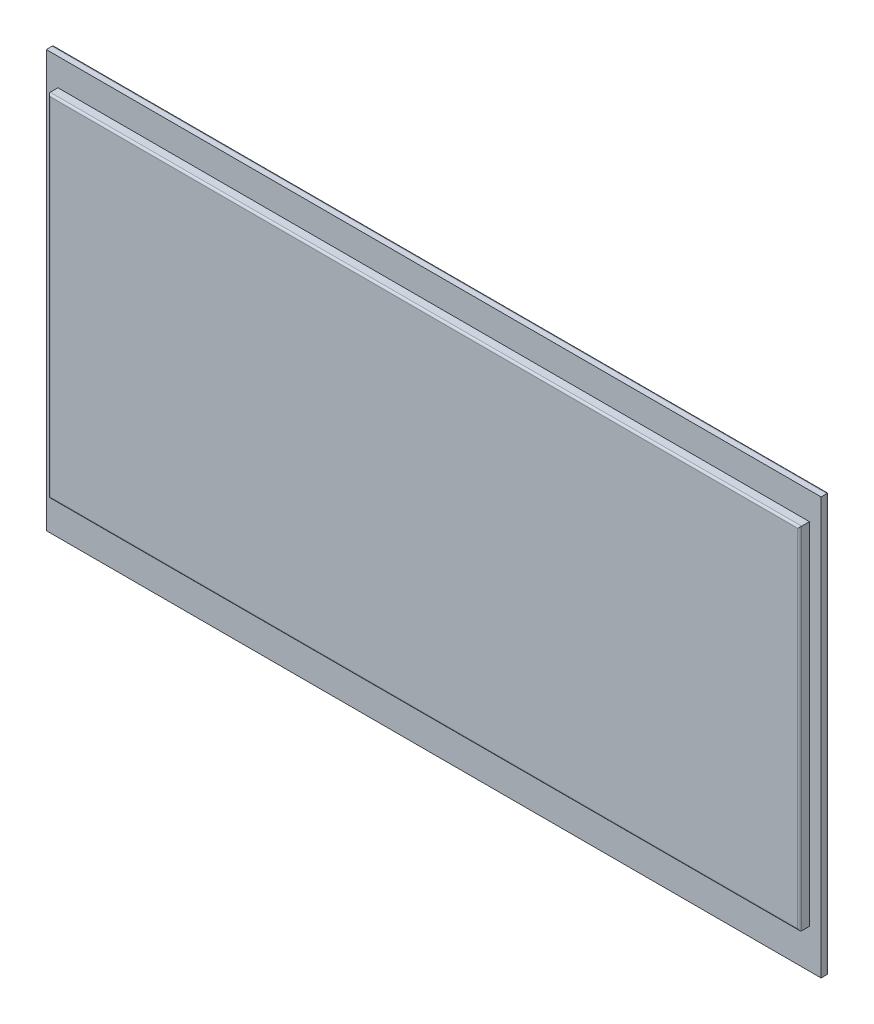
ISO-10303-21;
HEADER;
FILE_DESCRIPTION(('STEP AP214'),'2;1');
FILE_NAME('part.step','',(''),(''),'','','');
FILE_SCHEMA(('AUTOMOTIVE_DESIGN { 1 0 10303 214 1 1 1 1 }'));
ENDSEC;
DATA;
#1=APPLICATION_CONTEXT('core data for automotive mechanical design processes');
#2=APPLICATION_PROTOCOL_DEFINITION('international standard','automotive_design',2000,#1);
#3=PRODUCT_CONTEXT('',#1,'mechanical');
#4=PRODUCT('Part','Part','',(#3));
#5=PRODUCT_RELATED_PRODUCT_CATEGORY('part','',(#4));
#6=PRODUCT_DEFINITION_FORMATION('','',#4);
#7=PRODUCT_DEFINITION_CONTEXT('part definition',#1,'design');
#8=PRODUCT_DEFINITION('design','',#6,#7);
#9=PRODUCT_DEFINITION_SHAPE('','',#8);
#10=(LENGTH_UNIT() NAMED_UNIT(*) SI_UNIT(.MILLI.,.METRE.));
#11=(NAMED_UNIT(*) PLANE_ANGLE_UNIT() SI_UNIT($,.RADIAN.));
#12=(NAMED_UNIT(*) SI_UNIT($,.STERADIAN.) SOLID_ANGLE_UNIT());
#13=UNCERTAINTY_MEASURE_WITH_UNIT(LENGTH_MEASURE(1.E-05),#10,'distance_accuracy_value','');
#14=(GEOMETRIC_REPRESENTATION_CONTEXT(3) GLOBAL_UNCERTAINTY_ASSIGNED_CONTEXT((#13)) GLOBAL_UNIT_ASSIGNED_CONTEXT((#10,
#11,#12)) REPRESENTATION_CONTEXT('',''));
#15=CARTESIAN_POINT('',(0.,0.,0.));
#16=DIRECTION('',(0.,0.,1.));
#17=DIRECTION('',(1.,0.,0.));
#18=AXIS2_PLACEMENT_3D('',#15,#16,#17);
#19=CARTESIAN_POINT('',(0.,0.,2.));
#20=DIRECTION('',(0.,0.,-1.));
#21=DIRECTION('',(-1.,0.,0.));
#22=AXIS2_PLACEMENT_3D('',#19,#20,#21);
#23=PLANE('',#22);
#24=DIRECTION('',(0.,1.,0.));
#25=VECTOR('',#24,1.);
#26=CARTESIAN_POINT('',(99.5,-53.5,2.));
#27=LINE('',#26,#25);
#28=CARTESIAN_POINT('',(99.5,-53.5,2.));
#29=VERTEX_POINT('',#28);
#30=CARTESIAN_POINT('',(99.5,53.5,2.));
#31=VERTEX_POINT('',#30);
#32=EDGE_CURVE('E180',#29,#31,#27,.T.);
#33=ORIENTED_EDGE('',*,*,#32,.T.);
#34=DIRECTION('',(-1.,0.,0.));
#35=VECTOR('',#34,1.);
#36=CARTESIAN_POINT('',(-99.5,53.5,2.));
#37=LINE('',#36,#35);
#38=CARTESIAN_POINT('',(-99.5,53.5,2.));
#39=VERTEX_POINT('',#38);
#40=EDGE_CURVE('E184',#31,#39,#37,.T.);
#41=ORIENTED_EDGE('',*,*,#40,.T.);
#42=DIRECTION('',(0.,-1.,0.));
#43=VECTOR('',#42,1.);
#44=CARTESIAN_POINT('',(-99.5,-53.5,2.));
#45=LINE('',#44,#43);
#46=CARTESIAN_POINT('',(-99.5,-53.5,2.));
#47=VERTEX_POINT('',#46);
#48=EDGE_CURVE('E187',#39,#47,#45,.T.);
#49=ORIENTED_EDGE('',*,*,#48,.T.);
#50=DIRECTION('',(1.,0.,0.));
#51=VECTOR('',#50,1.);
#52=CARTESIAN_POINT('',(-99.5,-53.5,2.));
#53=LINE('',#52,#51);
#54=EDGE_CURVE('E190',#47,#29,#53,.T.);
#55=ORIENTED_EDGE('',*,*,#54,.T.);
#56=EDGE_LOOP('',(#33,#41,#49,#55));
#57=FACE_BOUND('',#56,.T.);
#58=DIRECTION('',(0.,-1.,0.));
#59=VECTOR('',#58,1.);
#60=CARTESIAN_POINT('',(-96.5,46.5,2.));
#61=LINE('',#60,#59);
#62=CARTESIAN_POINT('',(-96.5,46.5,2.));
#63=VERTEX_POINT('',#62);
#64=CARTESIAN_POINT('',(-96.5,-43.5,2.));
#65=VERTEX_POINT('',#64);
#66=EDGE_CURVE('E165',#63,#65,#61,.T.);
#67=ORIENTED_EDGE('',*,*,#66,.F.);
#68=DIRECTION('',(-1.,0.,0.));
#69=VECTOR('',#68,1.);
#70=CARTESIAN_POINT('',(-96.5,46.5,2.));
#71=LINE('',#70,#69);
#72=CARTESIAN_POINT('',(96.5,46.5,2.));
#73=VERTEX_POINT('',#72);
#74=EDGE_CURVE('E159',#73,#63,#71,.T.);
#75=ORIENTED_EDGE('',*,*,#74,.F.);
#76=DIRECTION('',(0.,1.,0.));
#77=VECTOR('',#76,1.);
#78=CARTESIAN_POINT('',(96.5,46.5,2.));
#79=LINE('',#78,#77);
#80=CARTESIAN_POINT('',(96.5,-43.5,2.));
#81=VERTEX_POINT('',#80);
#82=EDGE_CURVE('E142',#81,#73,#79,.T.);
#83=ORIENTED_EDGE('',*,*,#82,.F.);
#84=DIRECTION('',(1.,0.,0.));
#85=VECTOR('',#84,1.);
#86=CARTESIAN_POINT('',(-96.5,-43.5,2.));
#87=LINE('',#86,#85);
#88=EDGE_CURVE('E156',#65,#81,#87,.T.);
#89=ORIENTED_EDGE('',*,*,#88,.F.);
#90=EDGE_LOOP('',(#67,#75,#83,#89));
#91=FACE_BOUND('',#90,.T.);
#92=ADVANCED_FACE('F45',(#57,#91),#23,.F.);
#93=CARTESIAN_POINT('',(99.5,-53.5,2.));
#94=DIRECTION('',(-1.,0.,0.));
#95=DIRECTION('',(0.,0.,1.));
#96=AXIS2_PLACEMENT_3D('',#93,#94,#95);
#97=PLANE('',#96);
#98=DIRECTION('',(0.,0.,-1.));
#99=VECTOR('',#98,1.);
#100=CARTESIAN_POINT('',(99.5,-53.5,2.));
#101=LINE('',#100,#99);
#102=CARTESIAN_POINT('',(99.5,-53.5,0.5));
#103=VERTEX_POINT('',#102);
#104=EDGE_CURVE('E193',#29,#103,#101,.T.);
#105=ORIENTED_EDGE('',*,*,#104,.T.);
#106=DIRECTION('',(0.,1.,0.));
#107=VECTOR('',#106,1.);
#108=CARTESIAN_POINT('',(99.5,53.5,0.5));
#109=LINE('',#108,#107);
#110=CARTESIAN_POINT('',(99.5,53.5,0.5));
#111=VERTEX_POINT('',#110);
#112=EDGE_CURVE('E11',#103,#111,#109,.T.);
#113=ORIENTED_EDGE('',*,*,#112,.T.);
#114=DIRECTION('',(0.,0.,-1.));
#115=VECTOR('',#114,1.);
#116=CARTESIAN_POINT('',(99.5,53.5,2.));
#117=LINE('',#116,#115);
#118=EDGE_CURVE('E202',#31,#111,#117,.T.);
#119=ORIENTED_EDGE('',*,*,#118,.F.);
#120=ORIENTED_EDGE('',*,*,#32,.F.);
#121=EDGE_LOOP('',(#105,#113,#119,#120));
#122=FACE_BOUND('',#121,.T.);
#123=ADVANCED_FACE('F304',(#122),#97,.F.);
#124=CARTESIAN_POINT('',(-99.5,53.5,2.));
#125=DIRECTION('',(0.,-1.,0.));
#126=DIRECTION('',(0.,0.,-1.));
#127=AXIS2_PLACEMENT_3D('',#124,#125,#126);
#128=PLANE('',#127);
#129=ORIENTED_EDGE('',*,*,#118,.T.);
#130=DIRECTION('',(-1.,0.,0.));
#131=VECTOR('',#130,1.);
#132=CARTESIAN_POINT('',(-99.5,53.5,0.5));
#133=LINE('',#132,#131);
#134=CARTESIAN_POINT('',(-99.5,53.5,0.5));
#135=VERTEX_POINT('',#134);
#136=EDGE_CURVE('E231',#111,#135,#133,.T.);
#137=ORIENTED_EDGE('',*,*,#136,.T.);
#138=DIRECTION('',(0.,0.,-1.));
#139=VECTOR('',#138,1.);
#140=CARTESIAN_POINT('',(-99.5,53.5,2.));
#141=LINE('',#140,#139);
#142=EDGE_CURVE('E199',#39,#135,#141,.T.);
#143=ORIENTED_EDGE('',*,*,#142,.F.);
#144=ORIENTED_EDGE('',*,*,#40,.F.);
#145=EDGE_LOOP('',(#129,#137,#143,#144));
#146=FACE_BOUND('',#145,.T.);
#147=ADVANCED_FACE('F296',(#146),#128,.F.);
#148=CARTESIAN_POINT('',(-99.5,-53.5,2.));
#149=DIRECTION('',(1.,0.,0.));
#150=DIRECTION('',(0.,0.,-1.));
#151=AXIS2_PLACEMENT_3D('',#148,#149,#150);
#152=PLANE('',#151);
#153=ORIENTED_EDGE('',*,*,#142,.T.);
#154=DIRECTION('',(0.,-1.,0.));
#155=VECTOR('',#154,1.);
#156=CARTESIAN_POINT('',(-99.5,-53.5,0.5));
#157=LINE('',#156,#155);
#158=CARTESIAN_POINT('',(-99.5,-53.5,0.5));
#159=VERTEX_POINT('',#158);
#160=EDGE_CURVE('E70',#135,#159,#157,.T.);
#161=ORIENTED_EDGE('',*,*,#160,.T.);
#162=DIRECTION('',(0.,0.,-1.));
#163=VECTOR('',#162,1.);
#164=CARTESIAN_POINT('',(-99.5,-53.5,2.));
#165=LINE('',#164,#163);
#166=EDGE_CURVE('E196',#47,#159,#165,.T.);
#167=ORIENTED_EDGE('',*,*,#166,.F.);
#168=ORIENTED_EDGE('',*,*,#48,.F.);
#169=EDGE_LOOP('',(#153,#161,#167,#168));
#170=FACE_BOUND('',#169,.T.);
#171=ADVANCED_FACE('F299',(#170),#152,.F.);
#172=CARTESIAN_POINT('',(-99.5,-53.5,2.));
#173=DIRECTION('',(0.,1.,0.));
#174=DIRECTION('',(0.,0.,1.));
#175=AXIS2_PLACEMENT_3D('',#172,#173,#174);
#176=PLANE('',#175);
#177=ORIENTED_EDGE('',*,*,#166,.T.);
#178=DIRECTION('',(1.,0.,0.));
#179=VECTOR('',#178,1.);
#180=CARTESIAN_POINT('',(99.5,-53.5,0.5));
#181=LINE('',#180,#179);
#182=EDGE_CURVE('E55',#159,#103,#181,.T.);
#183=ORIENTED_EDGE('',*,*,#182,.T.);
#184=ORIENTED_EDGE('',*,*,#104,.F.);
#185=ORIENTED_EDGE('',*,*,#54,.F.);
#186=EDGE_LOOP('',(#177,#183,#184,#185));
#187=FACE_BOUND('',#186,.T.);
#188=ADVANCED_FACE('F305',(#187),#176,.F.);
#189=CARTESIAN_POINT('',(0.,0.,0.));
#190=DIRECTION('',(0.,0.,-1.));
#191=DIRECTION('',(-1.,0.,0.));
#192=AXIS2_PLACEMENT_3D('',#189,#190,#191);
#193=PLANE('',#192);
#194=DIRECTION('',(0.,-1.,0.));
#195=VECTOR('',#194,1.);
#196=CARTESIAN_POINT('',(-99.,53.5,0.));
#197=LINE('',#196,#195);
#198=CARTESIAN_POINT('',(-99.,-53.,0.));
#199=VERTEX_POINT('',#198);
#200=CARTESIAN_POINT('',(-99.,53.,0.));
#201=VERTEX_POINT('',#200);
#202=EDGE_CURVE('E254',#199,#201,#197,.F.);
#203=ORIENTED_EDGE('',*,*,#202,.T.);
#204=DIRECTION('',(-1.,0.,0.));
#205=VECTOR('',#204,1.);
#206=CARTESIAN_POINT('',(99.5,53.,0.));
#207=LINE('',#206,#205);
#208=CARTESIAN_POINT('',(99.,53.,0.));
#209=VERTEX_POINT('',#208);
#210=EDGE_CURVE('E257',#201,#209,#207,.F.);
#211=ORIENTED_EDGE('',*,*,#210,.T.);
#212=DIRECTION('',(0.,1.,0.));
#213=VECTOR('',#212,1.);
#214=CARTESIAN_POINT('',(99.,-53.5,0.));
#215=LINE('',#214,#213);
#216=CARTESIAN_POINT('',(99.,-53.,0.));
#217=VERTEX_POINT('',#216);
#218=EDGE_CURVE('E248',#209,#217,#215,.F.);
#219=ORIENTED_EDGE('',*,*,#218,.T.);
#220=DIRECTION('',(1.,0.,0.));
#221=VECTOR('',#220,1.);
#222=CARTESIAN_POINT('',(-99.5,-53.,0.));
#223=LINE('',#222,#221);
#224=EDGE_CURVE('E251',#217,#199,#223,.F.);
#225=ORIENTED_EDGE('',*,*,#224,.T.);
#226=EDGE_LOOP('',(#203,#211,#219,#225));
#227=FACE_BOUND('',#226,.T.);
#228=ADVANCED_FACE('F287',(#227),#193,.T.);
#229=CARTESIAN_POINT('',(-96.5,46.5,4.5));
#230=DIRECTION('',(1.,0.,0.));
#231=DIRECTION('',(0.,1.,0.));
#232=AXIS2_PLACEMENT_3D('',#229,#230,#231);
#233=PLANE('',#232);
#234=DIRECTION('',(0.,0.,-1.));
#235=VECTOR('',#234,1.);
#236=CARTESIAN_POINT('',(-96.5,-43.5,4.5));
#237=LINE('',#236,#235);
#238=CARTESIAN_POINT('',(-96.5,-43.5,4.));
#239=VERTEX_POINT('',#238);
#240=EDGE_CURVE('E149',#239,#65,#237,.T.);
#241=ORIENTED_EDGE('',*,*,#240,.F.);
#242=DIRECTION('',(0.,-1.,0.));
#243=VECTOR('',#242,1.);
#244=CARTESIAN_POINT('',(-96.5,46.5,4.));
#245=LINE('',#244,#243);
#246=CARTESIAN_POINT('',(-96.5,46.5,4.));
#247=VERTEX_POINT('',#246);
#248=EDGE_CURVE('E228',#239,#247,#245,.F.);
#249=ORIENTED_EDGE('',*,*,#248,.T.);
#250=DIRECTION('',(0.,0.,-1.));
#251=VECTOR('',#250,1.);
#252=CARTESIAN_POINT('',(-96.5,46.5,4.5));
#253=LINE('',#252,#251);
#254=EDGE_CURVE('E173',#247,#63,#253,.T.);
#255=ORIENTED_EDGE('',*,*,#254,.T.);
#256=ORIENTED_EDGE('',*,*,#66,.T.);
#257=EDGE_LOOP('',(#241,#249,#255,#256));
#258=FACE_BOUND('',#257,.T.);
#259=ADVANCED_FACE('F312',(#258),#233,.F.);
#260=CARTESIAN_POINT('',(-96.5,-43.5,4.5));
#261=DIRECTION('',(0.,1.,0.));
#262=DIRECTION('',(0.,0.,1.));
#263=AXIS2_PLACEMENT_3D('',#260,#261,#262);
#264=PLANE('',#263);
#265=DIRECTION('',(0.,0.,-1.));
#266=VECTOR('',#265,1.);
#267=CARTESIAN_POINT('',(96.5,-43.5,4.5));
#268=LINE('',#267,#266);
#269=CARTESIAN_POINT('',(96.5,-43.5,4.));
#270=VERTEX_POINT('',#269);
#271=EDGE_CURVE('E138',#270,#81,#268,.T.);
#272=ORIENTED_EDGE('',*,*,#271,.F.);
#273=DIRECTION('',(1.,0.,0.));
#274=VECTOR('',#273,1.);
#275=CARTESIAN_POINT('',(-96.5,-43.5,4.));
#276=LINE('',#275,#274);
#277=EDGE_CURVE('E225',#270,#239,#276,.F.);
#278=ORIENTED_EDGE('',*,*,#277,.T.);
#279=ORIENTED_EDGE('',*,*,#240,.T.);
#280=ORIENTED_EDGE('',*,*,#88,.T.);
#281=EDGE_LOOP('',(#272,#278,#279,#280));
#282=FACE_BOUND('',#281,.T.);
#283=ADVANCED_FACE('F162',(#282),#264,.F.);
#284=CARTESIAN_POINT('',(96.5,46.5,4.5));
#285=DIRECTION('',(-1.,0.,0.));
#286=DIRECTION('',(0.,-1.,0.));
#287=AXIS2_PLACEMENT_3D('',#284,#285,#286);
#288=PLANE('',#287);
#289=DIRECTION('',(0.,0.,-1.));
#290=VECTOR('',#289,1.);
#291=CARTESIAN_POINT('',(96.5,46.5,4.5));
#292=LINE('',#291,#290);
#293=CARTESIAN_POINT('',(96.5,46.5,4.));
#294=VERTEX_POINT('',#293);
#295=EDGE_CURVE('E150',#294,#73,#292,.T.);
#296=ORIENTED_EDGE('',*,*,#295,.F.);
#297=DIRECTION('',(0.,1.,0.));
#298=VECTOR('',#297,1.);
#299=CARTESIAN_POINT('',(96.5,-43.5,4.));
#300=LINE('',#299,#298);
#301=EDGE_CURVE('E144',#294,#270,#300,.F.);
#302=ORIENTED_EDGE('',*,*,#301,.T.);
#303=ORIENTED_EDGE('',*,*,#271,.T.);
#304=ORIENTED_EDGE('',*,*,#82,.T.);
#305=EDGE_LOOP('',(#296,#302,#303,#304));
#306=FACE_BOUND('',#305,.T.);
#307=ADVANCED_FACE('F141',(#306),#288,.F.);
#308=CARTESIAN_POINT('',(-96.5,46.5,4.5));
#309=DIRECTION('',(0.,-1.,0.));
#310=DIRECTION('',(0.,0.,-1.));
#311=AXIS2_PLACEMENT_3D('',#308,#309,#310);
#312=PLANE('',#311);
#313=ORIENTED_EDGE('',*,*,#254,.F.);
#314=DIRECTION('',(-1.,0.,0.));
#315=VECTOR('',#314,1.);
#316=CARTESIAN_POINT('',(96.5,46.5,4.));
#317=LINE('',#316,#315);
#318=EDGE_CURVE('E219',#247,#294,#317,.F.);
#319=ORIENTED_EDGE('',*,*,#318,.T.);
#320=ORIENTED_EDGE('',*,*,#295,.T.);
#321=ORIENTED_EDGE('',*,*,#74,.T.);
#322=EDGE_LOOP('',(#313,#319,#320,#321));
#323=FACE_BOUND('',#322,.T.);
#324=ADVANCED_FACE('F330',(#323),#312,.F.);
#325=CARTESIAN_POINT('',(0.,0.,4.5));
#326=DIRECTION('',(0.,0.,1.));
#327=DIRECTION('',(1.,0.,0.));
#328=AXIS2_PLACEMENT_3D('',#325,#326,#327);
#329=PLANE('',#328);
#330=DIRECTION('',(0.,1.,0.));
#331=VECTOR('',#330,1.);
#332=CARTESIAN_POINT('',(96.,46.5,4.5));
#333=LINE('',#332,#331);
#334=CARTESIAN_POINT('',(96.,-43.,4.5));
#335=VERTEX_POINT('',#334);
#336=CARTESIAN_POINT('',(96.,46.,4.5));
#337=VERTEX_POINT('',#336);
#338=EDGE_CURVE('E212',#335,#337,#333,.T.);
#339=ORIENTED_EDGE('',*,*,#338,.T.);
#340=DIRECTION('',(-1.,0.,0.));
#341=VECTOR('',#340,1.);
#342=CARTESIAN_POINT('',(-96.5,46.,4.5));
#343=LINE('',#342,#341);
#344=CARTESIAN_POINT('',(-96.,46.,4.5));
#345=VERTEX_POINT('',#344);
#346=EDGE_CURVE('E215',#337,#345,#343,.T.);
#347=ORIENTED_EDGE('',*,*,#346,.T.);
#348=DIRECTION('',(0.,-1.,0.));
#349=VECTOR('',#348,1.);
#350=CARTESIAN_POINT('',(-96.,-43.5,4.5));
#351=LINE('',#350,#349);
#352=CARTESIAN_POINT('',(-96.,-43.,4.5));
#353=VERTEX_POINT('',#352);
#354=EDGE_CURVE('E206',#345,#353,#351,.T.);
#355=ORIENTED_EDGE('',*,*,#354,.T.);
#356=DIRECTION('',(1.,0.,0.));
#357=VECTOR('',#356,1.);
#358=CARTESIAN_POINT('',(96.5,-43.,4.5));
#359=LINE('',#358,#357);
#360=EDGE_CURVE('E209',#353,#335,#359,.T.);
#361=ORIENTED_EDGE('',*,*,#360,.T.);
#362=EDGE_LOOP('',(#339,#347,#355,#361));
#363=FACE_BOUND('',#362,.T.);
#364=ADVANCED_FACE('F333',(#363),#329,.T.);
#365=CARTESIAN_POINT('',(0.,-43.,4.));
#366=DIRECTION('',(-1.,0.,0.));
#367=DIRECTION('',(0.,0.,1.));
#368=AXIS2_PLACEMENT_3D('',#365,#366,#367);
#369=CYLINDRICAL_SURFACE('',#368,0.5);
#370=CARTESIAN_POINT('',(-96.,-43.,4.));
#371=DIRECTION('',(-0.707106781186548,0.707106781186547,0.));
#372=DIRECTION('',(0.707106781186547,0.707106781186548,0.));
#373=AXIS2_PLACEMENT_3D('',#370,#371,#372);
#374=ELLIPSE('',#373,0.707106781186547,0.5);
#375=EDGE_CURVE('E238',#239,#353,#374,.T.);
#376=ORIENTED_EDGE('',*,*,#375,.F.);
#377=ORIENTED_EDGE('',*,*,#277,.F.);
#378=CARTESIAN_POINT('',(96.,-43.,4.));
#379=DIRECTION('',(-0.707106781186547,-0.707106781186548,0.));
#380=DIRECTION('',(-0.707106781186548,0.707106781186547,0.));
#381=AXIS2_PLACEMENT_3D('',#378,#379,#380);
#382=ELLIPSE('',#381,0.707106781186548,0.5);
#383=EDGE_CURVE('E168',#335,#270,#382,.F.);
#384=ORIENTED_EDGE('',*,*,#383,.F.);
#385=ORIENTED_EDGE('',*,*,#360,.F.);
#386=EDGE_LOOP('',(#376,#377,#384,#385));
#387=FACE_BOUND('',#386,.T.);
#388=ADVANCED_FACE('F336',(#387),#369,.T.);
#389=CARTESIAN_POINT('',(96.,0.,4.));
#390=DIRECTION('',(0.,-1.,0.));
#391=DIRECTION('',(1.,0.,0.));
#392=AXIS2_PLACEMENT_3D('',#389,#390,#391);
#393=CYLINDRICAL_SURFACE('',#392,0.5);
#394=ORIENTED_EDGE('',*,*,#383,.T.);
#395=ORIENTED_EDGE('',*,*,#301,.F.);
#396=CARTESIAN_POINT('',(96.,46.,4.));
#397=DIRECTION('',(0.707106781186548,-0.707106781186547,0.));
#398=DIRECTION('',(-0.707106781186547,-0.707106781186548,0.));
#399=AXIS2_PLACEMENT_3D('',#396,#397,#398);
#400=ELLIPSE('',#399,0.707106781186547,0.5);
#401=EDGE_CURVE('E235',#337,#294,#400,.F.);
#402=ORIENTED_EDGE('',*,*,#401,.F.);
#403=ORIENTED_EDGE('',*,*,#338,.F.);
#404=EDGE_LOOP('',(#394,#395,#402,#403));
#405=FACE_BOUND('',#404,.T.);
#406=ADVANCED_FACE('F341',(#405),#393,.T.);
#407=CARTESIAN_POINT('',(-96.,0.,4.));
#408=DIRECTION('',(0.,1.,0.));
#409=DIRECTION('',(-1.,0.,0.));
#410=AXIS2_PLACEMENT_3D('',#407,#408,#409);
#411=CYLINDRICAL_SURFACE('',#410,0.5);
#412=ORIENTED_EDGE('',*,*,#375,.T.);
#413=ORIENTED_EDGE('',*,*,#354,.F.);
#414=CARTESIAN_POINT('',(-96.,46.,4.));
#415=DIRECTION('',(0.707106781186547,0.707106781186548,0.));
#416=DIRECTION('',(-0.707106781186548,0.707106781186547,0.));
#417=AXIS2_PLACEMENT_3D('',#414,#415,#416);
#418=ELLIPSE('',#417,0.707106781186548,0.5);
#419=EDGE_CURVE('E232',#247,#345,#418,.T.);
#420=ORIENTED_EDGE('',*,*,#419,.F.);
#421=ORIENTED_EDGE('',*,*,#248,.F.);
#422=EDGE_LOOP('',(#412,#413,#420,#421));
#423=FACE_BOUND('',#422,.T.);
#424=ADVANCED_FACE('F357',(#423),#411,.T.);
#425=CARTESIAN_POINT('',(0.,46.,4.));
#426=DIRECTION('',(1.,0.,0.));
#427=DIRECTION('',(0.,0.,-1.));
#428=AXIS2_PLACEMENT_3D('',#425,#426,#427);
#429=CYLINDRICAL_SURFACE('',#428,0.5);
#430=ORIENTED_EDGE('',*,*,#401,.T.);
#431=ORIENTED_EDGE('',*,*,#318,.F.);
#432=ORIENTED_EDGE('',*,*,#419,.T.);
#433=ORIENTED_EDGE('',*,*,#346,.F.);
#434=EDGE_LOOP('',(#430,#431,#432,#433));
#435=FACE_BOUND('',#434,.T.);
#436=ADVANCED_FACE('F352',(#435),#429,.T.);
#437=CARTESIAN_POINT('',(-99.5,-53.,0.5));
#438=DIRECTION('',(-1.,0.,0.));
#439=DIRECTION('',(0.,0.,1.));
#440=AXIS2_PLACEMENT_3D('',#437,#438,#439);
#441=CYLINDRICAL_SURFACE('',#440,0.5);
#442=CARTESIAN_POINT('',(-99.,-53.,0.5));
#443=DIRECTION('',(-0.707106781186547,0.707106781186547,0.));
#444=DIRECTION('',(-0.707106781186547,-0.707106781186547,0.));
#445=AXIS2_PLACEMENT_3D('',#442,#443,#444);
#446=ELLIPSE('',#445,0.707106781186547,0.5);
#447=EDGE_CURVE('E270',#199,#159,#446,.T.);
#448=ORIENTED_EDGE('',*,*,#447,.F.);
#449=ORIENTED_EDGE('',*,*,#224,.F.);
#450=CARTESIAN_POINT('',(99.,-53.,0.5));
#451=DIRECTION('',(-0.707106781186547,-0.707106781186547,0.));
#452=DIRECTION('',(0.707106781186547,-0.707106781186547,0.));
#453=AXIS2_PLACEMENT_3D('',#450,#451,#452);
#454=ELLIPSE('',#453,0.707106781186547,0.5);
#455=EDGE_CURVE('E49',#103,#217,#454,.F.);
#456=ORIENTED_EDGE('',*,*,#455,.F.);
#457=ORIENTED_EDGE('',*,*,#182,.F.);
#458=EDGE_LOOP('',(#448,#449,#456,#457));
#459=FACE_BOUND('',#458,.T.);
#460=ADVANCED_FACE('F47',(#459),#441,.T.);
#461=CARTESIAN_POINT('',(99.,-53.5,0.5));
#462=DIRECTION('',(0.,-1.,0.));
#463=DIRECTION('',(0.,0.,-1.));
#464=AXIS2_PLACEMENT_3D('',#461,#462,#463);
#465=CYLINDRICAL_SURFACE('',#464,0.5);
#466=ORIENTED_EDGE('',*,*,#455,.T.);
#467=ORIENTED_EDGE('',*,*,#218,.F.);
#468=CARTESIAN_POINT('',(99.,53.,0.5));
#469=DIRECTION('',(0.707106781186547,-0.707106781186547,0.));
#470=DIRECTION('',(-0.707106781186547,-0.707106781186547,0.));
#471=AXIS2_PLACEMENT_3D('',#468,#469,#470);
#472=ELLIPSE('',#471,0.707106781186547,0.5);
#473=EDGE_CURVE('E268',#111,#209,#472,.F.);
#474=ORIENTED_EDGE('',*,*,#473,.F.);
#475=ORIENTED_EDGE('',*,*,#112,.F.);
#476=EDGE_LOOP('',(#466,#467,#474,#475));
#477=FACE_BOUND('',#476,.T.);
#478=ADVANCED_FACE('F282',(#477),#465,.T.);
#479=CARTESIAN_POINT('',(-99.,-53.5,0.5));
#480=DIRECTION('',(0.,1.,0.));
#481=DIRECTION('',(0.,0.,1.));
#482=AXIS2_PLACEMENT_3D('',#479,#480,#481);
#483=CYLINDRICAL_SURFACE('',#482,0.5);
#484=ORIENTED_EDGE('',*,*,#447,.T.);
#485=ORIENTED_EDGE('',*,*,#160,.F.);
#486=CARTESIAN_POINT('',(-99.,53.,0.5));
#487=DIRECTION('',(0.707106781186547,0.707106781186547,0.));
#488=DIRECTION('',(-0.707106781186547,0.707106781186547,0.));
#489=AXIS2_PLACEMENT_3D('',#486,#487,#488);
#490=ELLIPSE('',#489,0.707106781186547,0.5);
#491=EDGE_CURVE('E265',#201,#135,#490,.T.);
#492=ORIENTED_EDGE('',*,*,#491,.F.);
#493=ORIENTED_EDGE('',*,*,#202,.F.);
#494=EDGE_LOOP('',(#484,#485,#492,#493));
#495=FACE_BOUND('',#494,.T.);
#496=ADVANCED_FACE('F293',(#495),#483,.T.);
#497=CARTESIAN_POINT('',(-99.5,53.,0.5));
#498=DIRECTION('',(1.,0.,0.));
#499=DIRECTION('',(0.,0.,-1.));
#500=AXIS2_PLACEMENT_3D('',#497,#498,#499);
#501=CYLINDRICAL_SURFACE('',#500,0.5);
#502=ORIENTED_EDGE('',*,*,#473,.T.);
#503=ORIENTED_EDGE('',*,*,#210,.F.);
#504=ORIENTED_EDGE('',*,*,#491,.T.);
#505=ORIENTED_EDGE('',*,*,#136,.F.);
#506=EDGE_LOOP('',(#502,#503,#504,#505));
#507=FACE_BOUND('',#506,.T.);
#508=ADVANCED_FACE('F291',(#507),#501,.T.);
#509=CLOSED_SHELL('',(#92,#123,#147,#171,#188,#228,#259,#283,#307,#324,#364,#388,#406,#424,#436,
#460,#478,#496,#508));
#510=MANIFOLD_SOLID_BREP('B2',#509);
#511=ADVANCED_BREP_SHAPE_REPRESENTATION('',(#18,#510),#14);
#512=SHAPE_DEFINITION_REPRESENTATION(#9,#511);
ENDSEC;
END-ISO-10303-21;
